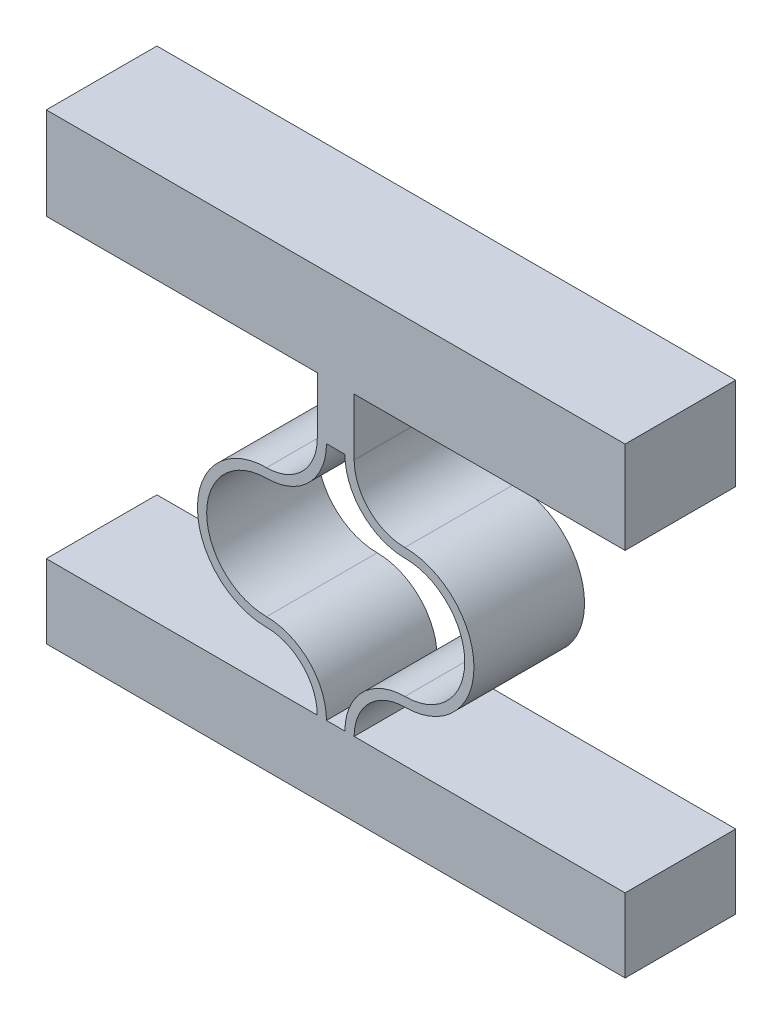
ISO-10303-21;
HEADER;
FILE_DESCRIPTION(('STEP AP214'),'2;1');
FILE_NAME('part.step','',(''),(''),'','','');
FILE_SCHEMA(('AUTOMOTIVE_DESIGN { 1 0 10303 214 1 1 1 1 }'));
ENDSEC;
DATA;
#1=APPLICATION_CONTEXT('core data for automotive mechanical design processes');
#2=APPLICATION_PROTOCOL_DEFINITION('international standard','automotive_design',2000,#1);
#3=PRODUCT_CONTEXT('',#1,'mechanical');
#4=PRODUCT('Part','Part','',(#3));
#5=PRODUCT_RELATED_PRODUCT_CATEGORY('part','',(#4));
#6=PRODUCT_DEFINITION_FORMATION('','',#4);
#7=PRODUCT_DEFINITION_CONTEXT('part definition',#1,'design');
#8=PRODUCT_DEFINITION('design','',#6,#7);
#9=PRODUCT_DEFINITION_SHAPE('','',#8);
#10=(LENGTH_UNIT() NAMED_UNIT(*) SI_UNIT(.MILLI.,.METRE.));
#11=(NAMED_UNIT(*) PLANE_ANGLE_UNIT() SI_UNIT($,.RADIAN.));
#12=(NAMED_UNIT(*) SI_UNIT($,.STERADIAN.) SOLID_ANGLE_UNIT());
#13=UNCERTAINTY_MEASURE_WITH_UNIT(LENGTH_MEASURE(1.E-05),#10,'distance_accuracy_value','');
#14=(GEOMETRIC_REPRESENTATION_CONTEXT(3) GLOBAL_UNCERTAINTY_ASSIGNED_CONTEXT((#13)) GLOBAL_UNIT_ASSIGNED_CONTEXT((#10,
#11,#12)) REPRESENTATION_CONTEXT('',''));
#15=CARTESIAN_POINT('',(0.,0.,0.));
#16=DIRECTION('',(0.,0.,1.));
#17=DIRECTION('',(1.,0.,0.));
#18=AXIS2_PLACEMENT_3D('',#15,#16,#17);
#19=CARTESIAN_POINT('',(13.4500001740405,13.,6.));
#20=DIRECTION('',(0.,0.,-1.));
#21=DIRECTION('',(-1.,0.,0.));
#22=AXIS2_PLACEMENT_3D('',#19,#20,#21);
#23=CYLINDRICAL_SURFACE('',#22,3.25);
#24=CARTESIAN_POINT('',(13.4500001740405,13.,0.));
#25=DIRECTION('',(0.,0.,1.));
#26=DIRECTION('',(1.,0.,0.));
#27=AXIS2_PLACEMENT_3D('',#24,#25,#26);
#28=CIRCLE('',#27,3.25);
#29=CARTESIAN_POINT('',(10.2000001740405,13.,0.));
#30=VERTEX_POINT('',#29);
#31=CARTESIAN_POINT('',(13.4500001740405,9.75,0.));
#32=VERTEX_POINT('',#31);
#33=EDGE_CURVE('E347',#30,#32,#28,.T.);
#34=ORIENTED_EDGE('',*,*,#33,.T.);
#35=DIRECTION('',(0.,0.,-1.));
#36=VECTOR('',#35,1.);
#37=CARTESIAN_POINT('',(13.4500001740405,9.75,6.));
#38=LINE('',#37,#36);
#39=CARTESIAN_POINT('',(13.4500001740405,9.75,6.));
#40=VERTEX_POINT('',#39);
#41=EDGE_CURVE('E310',#40,#32,#38,.T.);
#42=ORIENTED_EDGE('',*,*,#41,.F.);
#43=CARTESIAN_POINT('',(13.4500001740405,13.,6.));
#44=DIRECTION('',(0.,0.,1.));
#45=DIRECTION('',(1.,0.,0.));
#46=AXIS2_PLACEMENT_3D('',#43,#44,#45);
#47=CIRCLE('',#46,3.25);
#48=CARTESIAN_POINT('',(10.2000001740405,13.,6.));
#49=VERTEX_POINT('',#48);
#50=EDGE_CURVE('E370',#49,#40,#47,.T.);
#51=ORIENTED_EDGE('',*,*,#50,.F.);
#52=DIRECTION('',(0.,0.,-1.));
#53=VECTOR('',#52,1.);
#54=CARTESIAN_POINT('',(10.2000001740405,13.,6.));
#55=LINE('',#54,#53);
#56=EDGE_CURVE('E314',#49,#30,#55,.T.);
#57=ORIENTED_EDGE('',*,*,#56,.T.);
#58=EDGE_LOOP('',(#34,#42,#51,#57));
#59=FACE_BOUND('',#58,.T.);
#60=ADVANCED_FACE('F42',(#59),#23,.T.);
#61=CARTESIAN_POINT('',(13.4500001740405,6.5,6.));
#62=DIRECTION('',(0.,0.,-1.));
#63=DIRECTION('',(-1.,0.,0.));
#64=AXIS2_PLACEMENT_3D('',#61,#62,#63);
#65=CYLINDRICAL_SURFACE('',#64,3.25);
#66=CARTESIAN_POINT('',(13.4500001740405,6.5,0.));
#67=DIRECTION('',(0.,0.,1.));
#68=DIRECTION('',(1.,0.,0.));
#69=AXIS2_PLACEMENT_3D('',#66,#67,#68);
#70=CIRCLE('',#69,3.25);
#71=CARTESIAN_POINT('',(13.4500001740405,3.25,0.));
#72=VERTEX_POINT('',#71);
#73=EDGE_CURVE('E344',#32,#72,#70,.F.);
#74=ORIENTED_EDGE('',*,*,#73,.T.);
#75=DIRECTION('',(0.,0.,-1.));
#76=VECTOR('',#75,1.);
#77=CARTESIAN_POINT('',(13.4500001740405,3.25,6.));
#78=LINE('',#77,#76);
#79=CARTESIAN_POINT('',(13.4500001740405,3.25,6.));
#80=VERTEX_POINT('',#79);
#81=EDGE_CURVE('E313',#80,#72,#78,.T.);
#82=ORIENTED_EDGE('',*,*,#81,.F.);
#83=CARTESIAN_POINT('',(13.4500001740405,6.5,6.));
#84=DIRECTION('',(0.,0.,1.));
#85=DIRECTION('',(1.,0.,0.));
#86=AXIS2_PLACEMENT_3D('',#83,#84,#85);
#87=CIRCLE('',#86,3.25);
#88=EDGE_CURVE('E367',#40,#80,#87,.F.);
#89=ORIENTED_EDGE('',*,*,#88,.F.);
#90=ORIENTED_EDGE('',*,*,#41,.T.);
#91=EDGE_LOOP('',(#74,#82,#89,#90));
#92=FACE_BOUND('',#91,.T.);
#93=ADVANCED_FACE('F427',(#92),#65,.F.);
#94=CARTESIAN_POINT('',(13.4500001740405,0.,6.));
#95=DIRECTION('',(0.,0.,-1.));
#96=DIRECTION('',(-1.,0.,0.));
#97=AXIS2_PLACEMENT_3D('',#94,#95,#96);
#98=CYLINDRICAL_SURFACE('',#97,3.25);
#99=CARTESIAN_POINT('',(13.4500001740405,0.,0.));
#100=DIRECTION('',(0.,0.,1.));
#101=DIRECTION('',(1.,0.,0.));
#102=AXIS2_PLACEMENT_3D('',#99,#100,#101);
#103=CIRCLE('',#102,3.25);
#104=CARTESIAN_POINT('',(10.2000001740405,0.,0.));
#105=VERTEX_POINT('',#104);
#106=EDGE_CURVE('E342',#72,#105,#103,.T.);
#107=ORIENTED_EDGE('',*,*,#106,.T.);
#108=DIRECTION('',(0.,0.,-1.));
#109=VECTOR('',#108,1.);
#110=CARTESIAN_POINT('',(10.2000001740405,0.,6.));
#111=LINE('',#110,#109);
#112=CARTESIAN_POINT('',(10.2000001740405,0.,6.));
#113=VERTEX_POINT('',#112);
#114=EDGE_CURVE('E309',#113,#105,#111,.T.);
#115=ORIENTED_EDGE('',*,*,#114,.F.);
#116=CARTESIAN_POINT('',(13.4500001740405,0.,6.));
#117=DIRECTION('',(0.,0.,1.));
#118=DIRECTION('',(1.,0.,0.));
#119=AXIS2_PLACEMENT_3D('',#116,#117,#118);
#120=CIRCLE('',#119,3.25);
#121=EDGE_CURVE('E365',#80,#113,#120,.T.);
#122=ORIENTED_EDGE('',*,*,#121,.F.);
#123=ORIENTED_EDGE('',*,*,#81,.T.);
#124=EDGE_LOOP('',(#107,#115,#122,#123));
#125=FACE_BOUND('',#124,.T.);
#126=ADVANCED_FACE('F433',(#125),#98,.T.);
#127=CARTESIAN_POINT('',(0.,-4.00000000000024,6.));
#128=DIRECTION('',(0.,1.,0.));
#129=DIRECTION('',(-1.,0.,0.));
#130=AXIS2_PLACEMENT_3D('',#127,#128,#129);
#131=PLANE('',#130);
#132=DIRECTION('',(1.,0.,0.));
#133=VECTOR('',#132,1.);
#134=CARTESIAN_POINT('',(0.,-4.00000000000024,6.));
#135=LINE('',#134,#133);
#136=CARTESIAN_POINT('',(-5.99999965738466,-4.00000000000024,6.));
#137=VERTEX_POINT('',#136);
#138=CARTESIAN_POINT('',(25.4000000054657,-4.00000000000024,6.));
#139=VERTEX_POINT('',#138);
#140=EDGE_CURVE('E353',#137,#139,#135,.T.);
#141=ORIENTED_EDGE('',*,*,#140,.F.);
#142=DIRECTION('',(0.,0.,-1.));
#143=VECTOR('',#142,1.);
#144=CARTESIAN_POINT('',(-5.99999965738466,-4.00000000000024,6.));
#145=LINE('',#144,#143);
#146=CARTESIAN_POINT('',(-5.99999965738466,-4.00000000000024,0.));
#147=VERTEX_POINT('',#146);
#148=EDGE_CURVE('E252',#137,#147,#145,.T.);
#149=ORIENTED_EDGE('',*,*,#148,.T.);
#150=DIRECTION('',(1.,0.,0.));
#151=VECTOR('',#150,1.);
#152=CARTESIAN_POINT('',(0.,-4.00000000000024,0.));
#153=LINE('',#152,#151);
#154=CARTESIAN_POINT('',(25.4000000054657,-4.00000000000024,0.));
#155=VERTEX_POINT('',#154);
#156=EDGE_CURVE('E46',#147,#155,#153,.T.);
#157=ORIENTED_EDGE('',*,*,#156,.T.);
#158=DIRECTION('',(0.,0.,-1.));
#159=VECTOR('',#158,1.);
#160=CARTESIAN_POINT('',(25.4000000054657,-4.00000000000024,6.));
#161=LINE('',#160,#159);
#162=EDGE_CURVE('E322',#139,#155,#161,.T.);
#163=ORIENTED_EDGE('',*,*,#162,.F.);
#164=EDGE_LOOP('',(#141,#149,#157,#163));
#165=FACE_BOUND('',#164,.T.);
#166=ADVANCED_FACE('F386',(#165),#131,.F.);
#167=CARTESIAN_POINT('',(25.4000000054657,0.,6.));
#168=DIRECTION('',(-1.,0.,0.));
#169=DIRECTION('',(0.,0.,1.));
#170=AXIS2_PLACEMENT_3D('',#167,#168,#169);
#171=PLANE('',#170);
#172=DIRECTION('',(0.,1.,0.));
#173=VECTOR('',#172,1.);
#174=CARTESIAN_POINT('',(25.4000000054657,0.,0.));
#175=LINE('',#174,#173);
#176=CARTESIAN_POINT('',(25.4000000054657,0.,0.));
#177=VERTEX_POINT('',#176);
#178=EDGE_CURVE('E330',#155,#177,#175,.T.);
#179=ORIENTED_EDGE('',*,*,#178,.T.);
#180=DIRECTION('',(0.,0.,1.));
#181=VECTOR('',#180,1.);
#182=CARTESIAN_POINT('',(25.4000000054657,0.,0.));
#183=LINE('',#182,#181);
#184=CARTESIAN_POINT('',(25.4000000054657,0.,6.));
#185=VERTEX_POINT('',#184);
#186=EDGE_CURVE('E242',#177,#185,#183,.T.);
#187=ORIENTED_EDGE('',*,*,#186,.T.);
#188=DIRECTION('',(0.,1.,0.));
#189=VECTOR('',#188,1.);
#190=CARTESIAN_POINT('',(25.4000000054657,0.,6.));
#191=LINE('',#190,#189);
#192=EDGE_CURVE('E317',#139,#185,#191,.T.);
#193=ORIENTED_EDGE('',*,*,#192,.F.);
#194=ORIENTED_EDGE('',*,*,#162,.T.);
#195=EDGE_LOOP('',(#179,#187,#193,#194));
#196=FACE_BOUND('',#195,.T.);
#197=ADVANCED_FACE('F385',(#196),#171,.F.);
#198=CARTESIAN_POINT('',(10.7000399753727,-2.72436541784591E-12,6.));
#199=DIRECTION('',(-1.,2.54612639215959E-13,0.));
#200=DIRECTION('',(-2.54612639215959E-13,-1.,0.));
#201=AXIS2_PLACEMENT_3D('',#198,#199,#200);
#202=PLANE('',#201);
#203=DIRECTION('',(2.54612639215959E-13,1.,0.));
#204=VECTOR('',#203,1.);
#205=CARTESIAN_POINT('',(10.7000399753727,-2.72436541784591E-12,0.));
#206=LINE('',#205,#204);
#207=CARTESIAN_POINT('',(10.7000399753764,12.9852045357247,0.));
#208=VERTEX_POINT('',#207);
#209=CARTESIAN_POINT('',(10.7000399753764,16.0852045357246,0.));
#210=VERTEX_POINT('',#209);
#211=EDGE_CURVE('E51',#208,#210,#206,.T.);
#212=ORIENTED_EDGE('',*,*,#211,.T.);
#213=DIRECTION('',(0.,0.,-1.));
#214=VECTOR('',#213,1.);
#215=CARTESIAN_POINT('',(10.7000399753764,16.0852045357246,6.));
#216=LINE('',#215,#214);
#217=CARTESIAN_POINT('',(10.7000399753764,16.0852045357246,6.));
#218=VERTEX_POINT('',#217);
#219=EDGE_CURVE('E12',#218,#210,#216,.T.);
#220=ORIENTED_EDGE('',*,*,#219,.F.);
#221=DIRECTION('',(2.54612639215959E-13,1.,0.));
#222=VECTOR('',#221,1.);
#223=CARTESIAN_POINT('',(10.7000399753727,-2.72436541784591E-12,6.));
#224=LINE('',#223,#222);
#225=CARTESIAN_POINT('',(10.7000399753764,12.9852045357247,6.));
#226=VERTEX_POINT('',#225);
#227=EDGE_CURVE('E67',#226,#218,#224,.T.);
#228=ORIENTED_EDGE('',*,*,#227,.F.);
#229=DIRECTION('',(0.,0.,-1.));
#230=VECTOR('',#229,1.);
#231=CARTESIAN_POINT('',(10.7000399753764,12.9852045357247,6.));
#232=LINE('',#231,#230);
#233=EDGE_CURVE('E318',#226,#208,#232,.T.);
#234=ORIENTED_EDGE('',*,*,#233,.T.);
#235=EDGE_LOOP('',(#212,#220,#228,#234));
#236=FACE_BOUND('',#235,.T.);
#237=ADVANCED_FACE('F437',(#236),#202,.F.);
#238=CARTESIAN_POINT('',(0.,0.,6.));
#239=DIRECTION('',(0.,1.,0.));
#240=DIRECTION('',(-1.,0.,0.));
#241=AXIS2_PLACEMENT_3D('',#238,#239,#240);
#242=PLANE('',#241);
#243=DIRECTION('',(1.,0.,0.));
#244=VECTOR('',#243,1.);
#245=CARTESIAN_POINT('',(0.,0.,0.));
#246=LINE('',#245,#244);
#247=CARTESIAN_POINT('',(10.7000001740405,0.,0.));
#248=VERTEX_POINT('',#247);
#249=EDGE_CURVE('E59',#248,#177,#246,.T.);
#250=ORIENTED_EDGE('',*,*,#249,.F.);
#251=DIRECTION('',(0.,0.,-1.));
#252=VECTOR('',#251,1.);
#253=CARTESIAN_POINT('',(10.7000001740405,0.,6.));
#254=LINE('',#253,#252);
#255=CARTESIAN_POINT('',(10.7000001740405,0.,6.));
#256=VERTEX_POINT('',#255);
#257=EDGE_CURVE('E321',#256,#248,#254,.T.);
#258=ORIENTED_EDGE('',*,*,#257,.F.);
#259=DIRECTION('',(1.,0.,0.));
#260=VECTOR('',#259,1.);
#261=CARTESIAN_POINT('',(0.,0.,6.));
#262=LINE('',#261,#260);
#263=EDGE_CURVE('E360',#256,#185,#262,.T.);
#264=ORIENTED_EDGE('',*,*,#263,.T.);
#265=ORIENTED_EDGE('',*,*,#186,.F.);
#266=EDGE_LOOP('',(#250,#258,#264,#265));
#267=FACE_BOUND('',#266,.T.);
#268=ADVANCED_FACE('F448',(#267),#242,.T.);
#269=CARTESIAN_POINT('',(13.4500001740405,0.,6.));
#270=DIRECTION('',(0.,0.,-1.));
#271=DIRECTION('',(-1.,0.,0.));
#272=AXIS2_PLACEMENT_3D('',#269,#270,#271);
#273=CYLINDRICAL_SURFACE('',#272,2.75);
#274=CARTESIAN_POINT('',(13.4500001740405,0.,0.));
#275=DIRECTION('',(0.,0.,1.));
#276=DIRECTION('',(1.,0.,0.));
#277=AXIS2_PLACEMENT_3D('',#274,#275,#276);
#278=CIRCLE('',#277,2.75);
#279=CARTESIAN_POINT('',(13.4500001740405,2.75,0.));
#280=VERTEX_POINT('',#279);
#281=EDGE_CURVE('E336',#280,#248,#278,.T.);
#282=ORIENTED_EDGE('',*,*,#281,.F.);
#283=DIRECTION('',(0.,0.,-1.));
#284=VECTOR('',#283,1.);
#285=CARTESIAN_POINT('',(13.4500001740405,2.75,6.));
#286=LINE('',#285,#284);
#287=CARTESIAN_POINT('',(13.4500001740405,2.75,6.));
#288=VERTEX_POINT('',#287);
#289=EDGE_CURVE('E324',#288,#280,#286,.T.);
#290=ORIENTED_EDGE('',*,*,#289,.F.);
#291=CARTESIAN_POINT('',(13.4500001740405,0.,6.));
#292=DIRECTION('',(0.,0.,1.));
#293=DIRECTION('',(1.,0.,0.));
#294=AXIS2_PLACEMENT_3D('',#291,#292,#293);
#295=CIRCLE('',#294,2.75);
#296=EDGE_CURVE('E357',#288,#256,#295,.T.);
#297=ORIENTED_EDGE('',*,*,#296,.T.);
#298=ORIENTED_EDGE('',*,*,#257,.T.);
#299=EDGE_LOOP('',(#282,#290,#297,#298));
#300=FACE_BOUND('',#299,.T.);
#301=ADVANCED_FACE('F451',(#300),#273,.F.);
#302=CARTESIAN_POINT('',(13.4500001740405,6.5,6.));
#303=DIRECTION('',(0.,0.,-1.));
#304=DIRECTION('',(-1.,0.,0.));
#305=AXIS2_PLACEMENT_3D('',#302,#303,#304);
#306=CYLINDRICAL_SURFACE('',#305,3.75);
#307=CARTESIAN_POINT('',(13.4500001740405,6.5,0.));
#308=DIRECTION('',(0.,0.,1.));
#309=DIRECTION('',(1.,0.,0.));
#310=AXIS2_PLACEMENT_3D('',#307,#308,#309);
#311=CIRCLE('',#310,3.75);
#312=CARTESIAN_POINT('',(13.4500001740405,10.25,0.));
#313=VERTEX_POINT('',#312);
#314=EDGE_CURVE('E333',#313,#280,#311,.F.);
#315=ORIENTED_EDGE('',*,*,#314,.F.);
#316=DIRECTION('',(0.,0.,-1.));
#317=VECTOR('',#316,1.);
#318=CARTESIAN_POINT('',(13.4500001740405,10.25,6.));
#319=LINE('',#318,#317);
#320=CARTESIAN_POINT('',(13.4500001740405,10.25,6.));
#321=VERTEX_POINT('',#320);
#322=EDGE_CURVE('E326',#321,#313,#319,.T.);
#323=ORIENTED_EDGE('',*,*,#322,.F.);
#324=CARTESIAN_POINT('',(13.4500001740405,6.5,6.));
#325=DIRECTION('',(0.,0.,1.));
#326=DIRECTION('',(1.,0.,0.));
#327=AXIS2_PLACEMENT_3D('',#324,#325,#326);
#328=CIRCLE('',#327,3.75);
#329=EDGE_CURVE('E354',#321,#288,#328,.F.);
#330=ORIENTED_EDGE('',*,*,#329,.T.);
#331=ORIENTED_EDGE('',*,*,#289,.T.);
#332=EDGE_LOOP('',(#315,#323,#330,#331));
#333=FACE_BOUND('',#332,.T.);
#334=ADVANCED_FACE('F446',(#333),#306,.T.);
#335=CARTESIAN_POINT('',(13.4500001740405,13.,6.));
#336=DIRECTION('',(0.,0.,-1.));
#337=DIRECTION('',(-1.,0.,0.));
#338=AXIS2_PLACEMENT_3D('',#335,#336,#337);
#339=CYLINDRICAL_SURFACE('',#338,2.75);
#340=CARTESIAN_POINT('',(13.4500001740405,13.,0.));
#341=DIRECTION('',(0.,0.,1.));
#342=DIRECTION('',(1.,0.,0.));
#343=AXIS2_PLACEMENT_3D('',#340,#341,#342);
#344=CIRCLE('',#343,2.75);
#345=EDGE_CURVE('E339',#208,#313,#344,.T.);
#346=ORIENTED_EDGE('',*,*,#345,.F.);
#347=ORIENTED_EDGE('',*,*,#233,.F.);
#348=CARTESIAN_POINT('',(13.4500001740405,13.,6.));
#349=DIRECTION('',(0.,0.,1.));
#350=DIRECTION('',(1.,0.,0.));
#351=AXIS2_PLACEMENT_3D('',#348,#349,#350);
#352=CIRCLE('',#351,2.75);
#353=EDGE_CURVE('E362',#226,#321,#352,.T.);
#354=ORIENTED_EDGE('',*,*,#353,.T.);
#355=ORIENTED_EDGE('',*,*,#322,.T.);
#356=EDGE_LOOP('',(#346,#347,#354,#355));
#357=FACE_BOUND('',#356,.T.);
#358=ADVANCED_FACE('F443',(#357),#339,.F.);
#359=CARTESIAN_POINT('',(0.,0.,6.));
#360=DIRECTION('',(0.,0.,1.));
#361=DIRECTION('',(1.,0.,0.));
#362=AXIS2_PLACEMENT_3D('',#359,#360,#361);
#363=PLANE('',#362);
#364=DIRECTION('',(-1.,0.,0.));
#365=VECTOR('',#364,1.);
#366=CARTESIAN_POINT('',(19.400000348081,0.,6.));
#367=LINE('',#366,#365);
#368=CARTESIAN_POINT('',(8.7000001740405,0.,6.));
#369=VERTEX_POINT('',#368);
#370=CARTESIAN_POINT('',(-5.99999965738466,0.,6.));
#371=VERTEX_POINT('',#370);
#372=EDGE_CURVE('E275',#369,#371,#367,.T.);
#373=ORIENTED_EDGE('',*,*,#372,.T.);
#374=DIRECTION('',(0.,1.,0.));
#375=VECTOR('',#374,1.);
#376=CARTESIAN_POINT('',(-5.99999965738466,0.,6.));
#377=LINE('',#376,#375);
#378=EDGE_CURVE('E240',#137,#371,#377,.T.);
#379=ORIENTED_EDGE('',*,*,#378,.F.);
#380=ORIENTED_EDGE('',*,*,#140,.T.);
#381=ORIENTED_EDGE('',*,*,#192,.T.);
#382=ORIENTED_EDGE('',*,*,#263,.F.);
#383=ORIENTED_EDGE('',*,*,#296,.F.);
#384=ORIENTED_EDGE('',*,*,#329,.F.);
#385=ORIENTED_EDGE('',*,*,#353,.F.);
#386=ORIENTED_EDGE('',*,*,#227,.T.);
#387=DIRECTION('',(1.,0.,0.));
#388=VECTOR('',#387,1.);
#389=CARTESIAN_POINT('',(-5.99999965738466,16.0852045357246,6.));
#390=LINE('',#389,#388);
#391=CARTESIAN_POINT('',(25.4000000054657,16.0852045357246,6.));
#392=VERTEX_POINT('',#391);
#393=EDGE_CURVE('E535',#218,#392,#390,.T.);
#394=ORIENTED_EDGE('',*,*,#393,.T.);
#395=DIRECTION('',(0.,1.,0.));
#396=VECTOR('',#395,1.);
#397=CARTESIAN_POINT('',(25.4000000054657,21.085204541115,6.));
#398=LINE('',#397,#396);
#399=CARTESIAN_POINT('',(25.4000000054657,21.085204541115,6.));
#400=VERTEX_POINT('',#399);
#401=EDGE_CURVE('E530',#392,#400,#398,.T.);
#402=ORIENTED_EDGE('',*,*,#401,.T.);
#403=DIRECTION('',(-1.,0.,0.));
#404=VECTOR('',#403,1.);
#405=CARTESIAN_POINT('',(-5.99999965738466,21.085204541115,6.));
#406=LINE('',#405,#404);
#407=CARTESIAN_POINT('',(-5.99999965738466,21.085204541115,6.));
#408=VERTEX_POINT('',#407);
#409=EDGE_CURVE('E520',#400,#408,#406,.T.);
#410=ORIENTED_EDGE('',*,*,#409,.T.);
#411=DIRECTION('',(0.,-1.,0.));
#412=VECTOR('',#411,1.);
#413=CARTESIAN_POINT('',(-5.99999965738466,21.085204541115,6.));
#414=LINE('',#413,#412);
#415=CARTESIAN_POINT('',(-5.99999965738466,16.0852045357246,6.));
#416=VERTEX_POINT('',#415);
#417=EDGE_CURVE('E241',#408,#416,#414,.T.);
#418=ORIENTED_EDGE('',*,*,#417,.T.);
#419=CARTESIAN_POINT('',(8.69996037270463,16.0852045357246,6.));
#420=VERTEX_POINT('',#419);
#421=EDGE_CURVE('E533',#416,#420,#390,.T.);
#422=ORIENTED_EDGE('',*,*,#421,.T.);
#423=DIRECTION('',(-2.54612639215959E-13,1.,0.));
#424=VECTOR('',#423,1.);
#425=CARTESIAN_POINT('',(8.69996037270832,-2.72436541784591E-12,6.));
#426=LINE('',#425,#424);
#427=CARTESIAN_POINT('',(8.69996037270463,12.9852045357247,6.));
#428=VERTEX_POINT('',#427);
#429=EDGE_CURVE('E246',#428,#420,#426,.T.);
#430=ORIENTED_EDGE('',*,*,#429,.F.);
#431=CARTESIAN_POINT('',(5.9500001740405,13.,6.));
#432=DIRECTION('',(0.,0.,-1.));
#433=DIRECTION('',(-1.,0.,0.));
#434=AXIS2_PLACEMENT_3D('',#431,#432,#433);
#435=CIRCLE('',#434,2.75);
#436=CARTESIAN_POINT('',(5.9500001740405,10.25,6.));
#437=VERTEX_POINT('',#436);
#438=EDGE_CURVE('E277',#428,#437,#435,.T.);
#439=ORIENTED_EDGE('',*,*,#438,.T.);
#440=CARTESIAN_POINT('',(5.9500001740405,6.5,6.));
#441=DIRECTION('',(0.,0.,-1.));
#442=DIRECTION('',(-1.,0.,0.));
#443=AXIS2_PLACEMENT_3D('',#440,#441,#442);
#444=CIRCLE('',#443,3.75);
#445=CARTESIAN_POINT('',(5.9500001740405,2.75,6.));
#446=VERTEX_POINT('',#445);
#447=EDGE_CURVE('E270',#437,#446,#444,.F.);
#448=ORIENTED_EDGE('',*,*,#447,.T.);
#449=CARTESIAN_POINT('',(5.9500001740405,0.,6.));
#450=DIRECTION('',(0.,0.,-1.));
#451=DIRECTION('',(-1.,0.,0.));
#452=AXIS2_PLACEMENT_3D('',#449,#450,#451);
#453=CIRCLE('',#452,2.75);
#454=EDGE_CURVE('E273',#446,#369,#453,.T.);
#455=ORIENTED_EDGE('',*,*,#454,.T.);
#456=EDGE_LOOP('',(#373,#379,#380,#381,#382,#383,#384,#385,#386,#394,#402,#410,#418,#422,#430,
#439,#448,#455));
#457=FACE_BOUND('',#456,.T.);
#458=DIRECTION('',(1.,0.,0.));
#459=VECTOR('',#458,1.);
#460=CARTESIAN_POINT('',(9.7000001740405,0.,6.));
#461=LINE('',#460,#459);
#462=CARTESIAN_POINT('',(9.2000001740405,0.,6.));
#463=VERTEX_POINT('',#462);
#464=EDGE_CURVE('E303',#463,#113,#461,.T.);
#465=ORIENTED_EDGE('',*,*,#464,.F.);
#466=CARTESIAN_POINT('',(5.9500001740405,0.,6.));
#467=DIRECTION('',(0.,0.,-1.));
#468=DIRECTION('',(-1.,0.,0.));
#469=AXIS2_PLACEMENT_3D('',#466,#467,#468);
#470=CIRCLE('',#469,3.25);
#471=CARTESIAN_POINT('',(5.9500001740405,3.25,6.));
#472=VERTEX_POINT('',#471);
#473=EDGE_CURVE('E279',#472,#463,#470,.T.);
#474=ORIENTED_EDGE('',*,*,#473,.F.);
#475=CARTESIAN_POINT('',(5.9500001740405,6.5,6.));
#476=DIRECTION('',(0.,0.,-1.));
#477=DIRECTION('',(-1.,0.,0.));
#478=AXIS2_PLACEMENT_3D('',#475,#476,#477);
#479=CIRCLE('',#478,3.25);
#480=CARTESIAN_POINT('',(5.9500001740405,9.75,6.));
#481=VERTEX_POINT('',#480);
#482=EDGE_CURVE('E282',#481,#472,#479,.F.);
#483=ORIENTED_EDGE('',*,*,#482,.F.);
#484=CARTESIAN_POINT('',(5.9500001740405,13.,6.));
#485=DIRECTION('',(0.,0.,-1.));
#486=DIRECTION('',(-1.,0.,0.));
#487=AXIS2_PLACEMENT_3D('',#484,#485,#486);
#488=CIRCLE('',#487,3.25);
#489=CARTESIAN_POINT('',(9.2000001740405,13.,6.));
#490=VERTEX_POINT('',#489);
#491=EDGE_CURVE('E249',#490,#481,#488,.T.);
#492=ORIENTED_EDGE('',*,*,#491,.F.);
#493=DIRECTION('',(1.,0.,0.));
#494=VECTOR('',#493,1.);
#495=CARTESIAN_POINT('',(9.7000001740405,13.,6.));
#496=LINE('',#495,#494);
#497=EDGE_CURVE('E289',#490,#49,#496,.T.);
#498=ORIENTED_EDGE('',*,*,#497,.T.);
#499=ORIENTED_EDGE('',*,*,#50,.T.);
#500=ORIENTED_EDGE('',*,*,#88,.T.);
#501=ORIENTED_EDGE('',*,*,#121,.T.);
#502=EDGE_LOOP('',(#465,#474,#483,#492,#498,#499,#500,#501));
#503=FACE_BOUND('',#502,.T.);
#504=ADVANCED_FACE('F378',(#457,#503),#363,.T.);
#505=CARTESIAN_POINT('',(0.,0.,0.));
#506=DIRECTION('',(0.,0.,1.));
#507=DIRECTION('',(1.,0.,0.));
#508=AXIS2_PLACEMENT_3D('',#505,#506,#507);
#509=PLANE('',#508);
#510=DIRECTION('',(0.,1.,0.));
#511=VECTOR('',#510,1.);
#512=CARTESIAN_POINT('',(-5.99999965738466,0.,0.));
#513=LINE('',#512,#511);
#514=CARTESIAN_POINT('',(-5.99999965738466,0.,0.));
#515=VERTEX_POINT('',#514);
#516=EDGE_CURVE('E237',#147,#515,#513,.T.);
#517=ORIENTED_EDGE('',*,*,#516,.T.);
#518=DIRECTION('',(-1.,0.,0.));
#519=VECTOR('',#518,1.);
#520=CARTESIAN_POINT('',(19.400000348081,0.,0.));
#521=LINE('',#520,#519);
#522=CARTESIAN_POINT('',(8.7000001740405,0.,0.));
#523=VERTEX_POINT('',#522);
#524=EDGE_CURVE('E220',#523,#515,#521,.T.);
#525=ORIENTED_EDGE('',*,*,#524,.F.);
#526=CARTESIAN_POINT('',(5.9500001740405,0.,0.));
#527=DIRECTION('',(0.,0.,-1.));
#528=DIRECTION('',(-1.,0.,0.));
#529=AXIS2_PLACEMENT_3D('',#526,#527,#528);
#530=CIRCLE('',#529,2.75);
#531=CARTESIAN_POINT('',(5.9500001740405,2.75,0.));
#532=VERTEX_POINT('',#531);
#533=EDGE_CURVE('E231',#532,#523,#530,.T.);
#534=ORIENTED_EDGE('',*,*,#533,.F.);
#535=CARTESIAN_POINT('',(5.9500001740405,6.5,0.));
#536=DIRECTION('',(0.,0.,-1.));
#537=DIRECTION('',(-1.,0.,0.));
#538=AXIS2_PLACEMENT_3D('',#535,#536,#537);
#539=CIRCLE('',#538,3.75);
#540=CARTESIAN_POINT('',(5.9500001740405,10.25,0.));
#541=VERTEX_POINT('',#540);
#542=EDGE_CURVE('E245',#541,#532,#539,.F.);
#543=ORIENTED_EDGE('',*,*,#542,.F.);
#544=CARTESIAN_POINT('',(5.9500001740405,13.,0.));
#545=DIRECTION('',(0.,0.,-1.));
#546=DIRECTION('',(-1.,0.,0.));
#547=AXIS2_PLACEMENT_3D('',#544,#545,#546);
#548=CIRCLE('',#547,2.75);
#549=CARTESIAN_POINT('',(8.69996037270463,12.9852045357247,0.));
#550=VERTEX_POINT('',#549);
#551=EDGE_CURVE('E230',#550,#541,#548,.T.);
#552=ORIENTED_EDGE('',*,*,#551,.F.);
#553=DIRECTION('',(-2.54612639215959E-13,1.,0.));
#554=VECTOR('',#553,1.);
#555=CARTESIAN_POINT('',(8.69996037270832,-2.72436541784591E-12,0.));
#556=LINE('',#555,#554);
#557=CARTESIAN_POINT('',(8.69996037270463,16.0852045357246,0.));
#558=VERTEX_POINT('',#557);
#559=EDGE_CURVE('E266',#550,#558,#556,.T.);
#560=ORIENTED_EDGE('',*,*,#559,.T.);
#561=DIRECTION('',(-1.,0.,0.));
#562=VECTOR('',#561,1.);
#563=CARTESIAN_POINT('',(-5.99999965738466,16.0852045357246,0.));
#564=LINE('',#563,#562);
#565=CARTESIAN_POINT('',(-5.99999965738466,16.0852045357246,0.));
#566=VERTEX_POINT('',#565);
#567=EDGE_CURVE('E516',#558,#566,#564,.T.);
#568=ORIENTED_EDGE('',*,*,#567,.T.);
#569=DIRECTION('',(0.,1.,0.));
#570=VECTOR('',#569,1.);
#571=CARTESIAN_POINT('',(-5.99999965738466,21.085204541115,0.));
#572=LINE('',#571,#570);
#573=CARTESIAN_POINT('',(-5.99999965738466,21.085204541115,0.));
#574=VERTEX_POINT('',#573);
#575=EDGE_CURVE('E538',#566,#574,#572,.T.);
#576=ORIENTED_EDGE('',*,*,#575,.T.);
#577=DIRECTION('',(1.,0.,0.));
#578=VECTOR('',#577,1.);
#579=CARTESIAN_POINT('',(-5.99999965738466,21.085204541115,0.));
#580=LINE('',#579,#578);
#581=CARTESIAN_POINT('',(25.4000000054657,21.085204541115,0.));
#582=VERTEX_POINT('',#581);
#583=EDGE_CURVE('E540',#574,#582,#580,.T.);
#584=ORIENTED_EDGE('',*,*,#583,.T.);
#585=DIRECTION('',(0.,-1.,0.));
#586=VECTOR('',#585,1.);
#587=CARTESIAN_POINT('',(25.4000000054657,21.085204541115,0.));
#588=LINE('',#587,#586);
#589=CARTESIAN_POINT('',(25.4000000054657,16.0852045357246,0.));
#590=VERTEX_POINT('',#589);
#591=EDGE_CURVE('E527',#582,#590,#588,.T.);
#592=ORIENTED_EDGE('',*,*,#591,.T.);
#593=EDGE_CURVE('E298',#590,#210,#564,.T.);
#594=ORIENTED_EDGE('',*,*,#593,.T.);
#595=ORIENTED_EDGE('',*,*,#211,.F.);
#596=ORIENTED_EDGE('',*,*,#345,.T.);
#597=ORIENTED_EDGE('',*,*,#314,.T.);
#598=ORIENTED_EDGE('',*,*,#281,.T.);
#599=ORIENTED_EDGE('',*,*,#249,.T.);
#600=ORIENTED_EDGE('',*,*,#178,.F.);
#601=ORIENTED_EDGE('',*,*,#156,.F.);
#602=EDGE_LOOP('',(#517,#525,#534,#543,#552,#560,#568,#576,#584,#592,#594,#595,#596,#597,#598,
#599,#600,#601));
#603=FACE_BOUND('',#602,.T.);
#604=ORIENTED_EDGE('',*,*,#33,.F.);
#605=DIRECTION('',(1.,0.,0.));
#606=VECTOR('',#605,1.);
#607=CARTESIAN_POINT('',(9.7000001740405,13.,0.));
#608=LINE('',#607,#606);
#609=CARTESIAN_POINT('',(9.2000001740405,13.,0.));
#610=VERTEX_POINT('',#609);
#611=EDGE_CURVE('E301',#610,#30,#608,.T.);
#612=ORIENTED_EDGE('',*,*,#611,.F.);
#613=CARTESIAN_POINT('',(5.9500001740405,13.,0.));
#614=DIRECTION('',(0.,0.,-1.));
#615=DIRECTION('',(-1.,0.,0.));
#616=AXIS2_PLACEMENT_3D('',#613,#614,#615);
#617=CIRCLE('',#616,3.25);
#618=CARTESIAN_POINT('',(5.9500001740405,9.75,0.));
#619=VERTEX_POINT('',#618);
#620=EDGE_CURVE('E263',#610,#619,#617,.T.);
#621=ORIENTED_EDGE('',*,*,#620,.T.);
#622=CARTESIAN_POINT('',(5.9500001740405,6.5,0.));
#623=DIRECTION('',(0.,0.,-1.));
#624=DIRECTION('',(-1.,0.,0.));
#625=AXIS2_PLACEMENT_3D('',#622,#623,#624);
#626=CIRCLE('',#625,3.25);
#627=CARTESIAN_POINT('',(5.9500001740405,3.25,0.));
#628=VERTEX_POINT('',#627);
#629=EDGE_CURVE('E260',#619,#628,#626,.F.);
#630=ORIENTED_EDGE('',*,*,#629,.T.);
#631=CARTESIAN_POINT('',(5.9500001740405,0.,0.));
#632=DIRECTION('',(0.,0.,-1.));
#633=DIRECTION('',(-1.,0.,0.));
#634=AXIS2_PLACEMENT_3D('',#631,#632,#633);
#635=CIRCLE('',#634,3.25);
#636=CARTESIAN_POINT('',(9.2000001740405,0.,0.));
#637=VERTEX_POINT('',#636);
#638=EDGE_CURVE('E257',#628,#637,#635,.T.);
#639=ORIENTED_EDGE('',*,*,#638,.T.);
#640=DIRECTION('',(1.,0.,0.));
#641=VECTOR('',#640,1.);
#642=CARTESIAN_POINT('',(9.7000001740405,0.,0.));
#643=LINE('',#642,#641);
#644=EDGE_CURVE('E306',#637,#105,#643,.T.);
#645=ORIENTED_EDGE('',*,*,#644,.T.);
#646=ORIENTED_EDGE('',*,*,#106,.F.);
#647=ORIENTED_EDGE('',*,*,#73,.F.);
#648=EDGE_LOOP('',(#604,#612,#621,#630,#639,#645,#646,#647));
#649=FACE_BOUND('',#648,.T.);
#650=ADVANCED_FACE('F44',(#603,#649),#509,.F.);
#651=CARTESIAN_POINT('',(9.7000001740405,0.,0.));
#652=DIRECTION('',(0.,-1.,0.));
#653=DIRECTION('',(0.,0.,-1.));
#654=AXIS2_PLACEMENT_3D('',#651,#652,#653);
#655=PLANE('',#654);
#656=ORIENTED_EDGE('',*,*,#114,.T.);
#657=ORIENTED_EDGE('',*,*,#644,.F.);
#658=DIRECTION('',(0.,0.,-1.));
#659=VECTOR('',#658,1.);
#660=CARTESIAN_POINT('',(9.2000001740405,0.,6.));
#661=LINE('',#660,#659);
#662=EDGE_CURVE('E295',#463,#637,#661,.T.);
#663=ORIENTED_EDGE('',*,*,#662,.F.);
#664=ORIENTED_EDGE('',*,*,#464,.T.);
#665=EDGE_LOOP('',(#656,#657,#663,#664));
#666=FACE_BOUND('',#665,.T.);
#667=ADVANCED_FACE('F466',(#666),#655,.F.);
#668=CARTESIAN_POINT('',(9.7000001740405,13.,0.));
#669=DIRECTION('',(0.,1.,0.));
#670=DIRECTION('',(0.,0.,1.));
#671=AXIS2_PLACEMENT_3D('',#668,#669,#670);
#672=PLANE('',#671);
#673=ORIENTED_EDGE('',*,*,#56,.F.);
#674=ORIENTED_EDGE('',*,*,#497,.F.);
#675=DIRECTION('',(0.,0.,-1.));
#676=VECTOR('',#675,1.);
#677=CARTESIAN_POINT('',(9.2000001740405,13.,6.));
#678=LINE('',#677,#676);
#679=EDGE_CURVE('E290',#490,#610,#678,.T.);
#680=ORIENTED_EDGE('',*,*,#679,.T.);
#681=ORIENTED_EDGE('',*,*,#611,.T.);
#682=EDGE_LOOP('',(#673,#674,#680,#681));
#683=FACE_BOUND('',#682,.T.);
#684=ADVANCED_FACE('F470',(#683),#672,.F.);
#685=CARTESIAN_POINT('',(5.9500001740405,13.,6.));
#686=DIRECTION('',(0.,0.,-1.));
#687=DIRECTION('',(1.,0.,0.));
#688=AXIS2_PLACEMENT_3D('',#685,#686,#687);
#689=CYLINDRICAL_SURFACE('',#688,3.25);
#690=ORIENTED_EDGE('',*,*,#620,.F.);
#691=ORIENTED_EDGE('',*,*,#679,.F.);
#692=ORIENTED_EDGE('',*,*,#491,.T.);
#693=DIRECTION('',(0.,0.,-1.));
#694=VECTOR('',#693,1.);
#695=CARTESIAN_POINT('',(5.9500001740405,9.75,6.));
#696=LINE('',#695,#694);
#697=EDGE_CURVE('E293',#481,#619,#696,.T.);
#698=ORIENTED_EDGE('',*,*,#697,.T.);
#699=EDGE_LOOP('',(#690,#691,#692,#698));
#700=FACE_BOUND('',#699,.T.);
#701=ADVANCED_FACE('F475',(#700),#689,.T.);
#702=CARTESIAN_POINT('',(5.9500001740405,6.5,6.));
#703=DIRECTION('',(0.,0.,-1.));
#704=DIRECTION('',(1.,0.,0.));
#705=AXIS2_PLACEMENT_3D('',#702,#703,#704);
#706=CYLINDRICAL_SURFACE('',#705,3.25);
#707=ORIENTED_EDGE('',*,*,#629,.F.);
#708=ORIENTED_EDGE('',*,*,#697,.F.);
#709=ORIENTED_EDGE('',*,*,#482,.T.);
#710=DIRECTION('',(0.,0.,-1.));
#711=VECTOR('',#710,1.);
#712=CARTESIAN_POINT('',(5.9500001740405,3.25,6.));
#713=LINE('',#712,#711);
#714=EDGE_CURVE('E271',#472,#628,#713,.T.);
#715=ORIENTED_EDGE('',*,*,#714,.T.);
#716=EDGE_LOOP('',(#707,#708,#709,#715));
#717=FACE_BOUND('',#716,.T.);
#718=ADVANCED_FACE('F496',(#717),#706,.F.);
#719=CARTESIAN_POINT('',(5.9500001740405,0.,6.));
#720=DIRECTION('',(0.,0.,-1.));
#721=DIRECTION('',(1.,0.,0.));
#722=AXIS2_PLACEMENT_3D('',#719,#720,#721);
#723=CYLINDRICAL_SURFACE('',#722,3.25);
#724=ORIENTED_EDGE('',*,*,#638,.F.);
#725=ORIENTED_EDGE('',*,*,#714,.F.);
#726=ORIENTED_EDGE('',*,*,#473,.T.);
#727=ORIENTED_EDGE('',*,*,#662,.T.);
#728=EDGE_LOOP('',(#724,#725,#726,#727));
#729=FACE_BOUND('',#728,.T.);
#730=ADVANCED_FACE('F481',(#729),#723,.T.);
#731=CARTESIAN_POINT('',(-5.99999965738466,0.,6.));
#732=DIRECTION('',(1.,0.,0.));
#733=DIRECTION('',(0.,0.,1.));
#734=AXIS2_PLACEMENT_3D('',#731,#732,#733);
#735=PLANE('',#734);
#736=ORIENTED_EDGE('',*,*,#378,.T.);
#737=DIRECTION('',(0.,0.,1.));
#738=VECTOR('',#737,1.);
#739=CARTESIAN_POINT('',(-5.99999965738466,0.,0.));
#740=LINE('',#739,#738);
#741=EDGE_CURVE('E224',#515,#371,#740,.T.);
#742=ORIENTED_EDGE('',*,*,#741,.F.);
#743=ORIENTED_EDGE('',*,*,#516,.F.);
#744=ORIENTED_EDGE('',*,*,#148,.F.);
#745=EDGE_LOOP('',(#736,#742,#743,#744));
#746=FACE_BOUND('',#745,.T.);
#747=ADVANCED_FACE('F235',(#746),#735,.F.);
#748=CARTESIAN_POINT('',(8.69996037270832,-2.72436541784591E-12,6.));
#749=DIRECTION('',(1.,2.54612639215959E-13,0.));
#750=DIRECTION('',(2.54612639215959E-13,-1.,0.));
#751=AXIS2_PLACEMENT_3D('',#748,#749,#750);
#752=PLANE('',#751);
#753=ORIENTED_EDGE('',*,*,#559,.F.);
#754=DIRECTION('',(0.,0.,-1.));
#755=VECTOR('',#754,1.);
#756=CARTESIAN_POINT('',(8.69996037270463,12.9852045357247,6.));
#757=LINE('',#756,#755);
#758=EDGE_CURVE('E387',#428,#550,#757,.T.);
#759=ORIENTED_EDGE('',*,*,#758,.F.);
#760=ORIENTED_EDGE('',*,*,#429,.T.);
#761=DIRECTION('',(0.,0.,-1.));
#762=VECTOR('',#761,1.);
#763=CARTESIAN_POINT('',(8.69996037270463,16.0852045357246,6.));
#764=LINE('',#763,#762);
#765=EDGE_CURVE('E268',#420,#558,#764,.T.);
#766=ORIENTED_EDGE('',*,*,#765,.T.);
#767=EDGE_LOOP('',(#753,#759,#760,#766));
#768=FACE_BOUND('',#767,.T.);
#769=ADVANCED_FACE('F480',(#768),#752,.F.);
#770=CARTESIAN_POINT('',(19.400000348081,0.,6.));
#771=DIRECTION('',(0.,1.,0.));
#772=DIRECTION('',(1.,0.,0.));
#773=AXIS2_PLACEMENT_3D('',#770,#771,#772);
#774=PLANE('',#773);
#775=ORIENTED_EDGE('',*,*,#524,.T.);
#776=ORIENTED_EDGE('',*,*,#741,.T.);
#777=ORIENTED_EDGE('',*,*,#372,.F.);
#778=DIRECTION('',(0.,0.,-1.));
#779=VECTOR('',#778,1.);
#780=CARTESIAN_POINT('',(8.7000001740405,0.,6.));
#781=LINE('',#780,#779);
#782=EDGE_CURVE('E227',#369,#523,#781,.T.);
#783=ORIENTED_EDGE('',*,*,#782,.T.);
#784=EDGE_LOOP('',(#775,#776,#777,#783));
#785=FACE_BOUND('',#784,.T.);
#786=ADVANCED_FACE('F222',(#785),#774,.T.);
#787=CARTESIAN_POINT('',(5.9500001740405,0.,6.));
#788=DIRECTION('',(0.,0.,-1.));
#789=DIRECTION('',(1.,0.,0.));
#790=AXIS2_PLACEMENT_3D('',#787,#788,#789);
#791=CYLINDRICAL_SURFACE('',#790,2.75);
#792=ORIENTED_EDGE('',*,*,#533,.T.);
#793=ORIENTED_EDGE('',*,*,#782,.F.);
#794=ORIENTED_EDGE('',*,*,#454,.F.);
#795=DIRECTION('',(0.,0.,-1.));
#796=VECTOR('',#795,1.);
#797=CARTESIAN_POINT('',(5.9500001740405,2.75,6.));
#798=LINE('',#797,#796);
#799=EDGE_CURVE('E393',#446,#532,#798,.T.);
#800=ORIENTED_EDGE('',*,*,#799,.T.);
#801=EDGE_LOOP('',(#792,#793,#794,#800));
#802=FACE_BOUND('',#801,.T.);
#803=ADVANCED_FACE('F408',(#802),#791,.F.);
#804=CARTESIAN_POINT('',(5.9500001740405,6.5,6.));
#805=DIRECTION('',(0.,0.,-1.));
#806=DIRECTION('',(1.,0.,0.));
#807=AXIS2_PLACEMENT_3D('',#804,#805,#806);
#808=CYLINDRICAL_SURFACE('',#807,3.75);
#809=ORIENTED_EDGE('',*,*,#542,.T.);
#810=ORIENTED_EDGE('',*,*,#799,.F.);
#811=ORIENTED_EDGE('',*,*,#447,.F.);
#812=DIRECTION('',(0.,0.,-1.));
#813=VECTOR('',#812,1.);
#814=CARTESIAN_POINT('',(5.9500001740405,10.25,6.));
#815=LINE('',#814,#813);
#816=EDGE_CURVE('E294',#437,#541,#815,.T.);
#817=ORIENTED_EDGE('',*,*,#816,.T.);
#818=EDGE_LOOP('',(#809,#810,#811,#817));
#819=FACE_BOUND('',#818,.T.);
#820=ADVANCED_FACE('F404',(#819),#808,.T.);
#821=CARTESIAN_POINT('',(5.9500001740405,13.,6.));
#822=DIRECTION('',(0.,0.,-1.));
#823=DIRECTION('',(1.,0.,0.));
#824=AXIS2_PLACEMENT_3D('',#821,#822,#823);
#825=CYLINDRICAL_SURFACE('',#824,2.75);
#826=ORIENTED_EDGE('',*,*,#551,.T.);
#827=ORIENTED_EDGE('',*,*,#816,.F.);
#828=ORIENTED_EDGE('',*,*,#438,.F.);
#829=ORIENTED_EDGE('',*,*,#758,.T.);
#830=EDGE_LOOP('',(#826,#827,#828,#829));
#831=FACE_BOUND('',#830,.T.);
#832=ADVANCED_FACE('F411',(#831),#825,.F.);
#833=CARTESIAN_POINT('',(-5.99999965738466,16.0852045357246,-31.7955968473766));
#834=DIRECTION('',(0.,-1.,0.));
#835=DIRECTION('',(0.,0.,-1.));
#836=AXIS2_PLACEMENT_3D('',#833,#834,#835);
#837=PLANE('',#836);
#838=ORIENTED_EDGE('',*,*,#765,.F.);
#839=ORIENTED_EDGE('',*,*,#421,.F.);
#840=DIRECTION('',(0.,0.,1.));
#841=VECTOR('',#840,1.);
#842=CARTESIAN_POINT('',(-5.99999965738466,16.0852045357246,-31.7955968473766));
#843=LINE('',#842,#841);
#844=EDGE_CURVE('E517',#566,#416,#843,.T.);
#845=ORIENTED_EDGE('',*,*,#844,.F.);
#846=ORIENTED_EDGE('',*,*,#567,.F.);
#847=EDGE_LOOP('',(#838,#839,#845,#846));
#848=FACE_BOUND('',#847,.T.);
#849=ADVANCED_FACE('F413',(#848),#837,.T.);
#850=CARTESIAN_POINT('',(-5.99999965738466,21.085204541115,-31.7955968473766));
#851=DIRECTION('',(-1.,0.,0.));
#852=DIRECTION('',(0.,0.,1.));
#853=AXIS2_PLACEMENT_3D('',#850,#851,#852);
#854=PLANE('',#853);
#855=ORIENTED_EDGE('',*,*,#575,.F.);
#856=ORIENTED_EDGE('',*,*,#844,.T.);
#857=ORIENTED_EDGE('',*,*,#417,.F.);
#858=DIRECTION('',(0.,0.,1.));
#859=VECTOR('',#858,1.);
#860=CARTESIAN_POINT('',(-5.99999965738466,21.085204541115,-31.7955968473766));
#861=LINE('',#860,#859);
#862=EDGE_CURVE('E525',#574,#408,#861,.T.);
#863=ORIENTED_EDGE('',*,*,#862,.F.);
#864=EDGE_LOOP('',(#855,#856,#857,#863));
#865=FACE_BOUND('',#864,.T.);
#866=ADVANCED_FACE('F419',(#865),#854,.T.);
#867=CARTESIAN_POINT('',(-5.99999965738466,21.085204541115,-31.7955968473766));
#868=DIRECTION('',(0.,1.,0.));
#869=DIRECTION('',(0.,0.,1.));
#870=AXIS2_PLACEMENT_3D('',#867,#868,#869);
#871=PLANE('',#870);
#872=ORIENTED_EDGE('',*,*,#583,.F.);
#873=ORIENTED_EDGE('',*,*,#862,.T.);
#874=ORIENTED_EDGE('',*,*,#409,.F.);
#875=DIRECTION('',(0.,0.,1.));
#876=VECTOR('',#875,1.);
#877=CARTESIAN_POINT('',(25.4000000054657,21.085204541115,-31.7955968473766));
#878=LINE('',#877,#876);
#879=EDGE_CURVE('E523',#582,#400,#878,.T.);
#880=ORIENTED_EDGE('',*,*,#879,.F.);
#881=EDGE_LOOP('',(#872,#873,#874,#880));
#882=FACE_BOUND('',#881,.T.);
#883=ADVANCED_FACE('F736',(#882),#871,.T.);
#884=CARTESIAN_POINT('',(25.4000000054657,21.085204541115,-31.7955968473766));
#885=DIRECTION('',(1.,0.,0.));
#886=DIRECTION('',(0.,0.,-1.));
#887=AXIS2_PLACEMENT_3D('',#884,#885,#886);
#888=PLANE('',#887);
#889=ORIENTED_EDGE('',*,*,#591,.F.);
#890=ORIENTED_EDGE('',*,*,#879,.T.);
#891=ORIENTED_EDGE('',*,*,#401,.F.);
#892=DIRECTION('',(0.,0.,1.));
#893=VECTOR('',#892,1.);
#894=CARTESIAN_POINT('',(25.4000000054657,16.0852045357246,-31.7955968473766));
#895=LINE('',#894,#893);
#896=EDGE_CURVE('E519',#590,#392,#895,.T.);
#897=ORIENTED_EDGE('',*,*,#896,.F.);
#898=EDGE_LOOP('',(#889,#890,#891,#897));
#899=FACE_BOUND('',#898,.T.);
#900=ADVANCED_FACE('F550',(#899),#888,.T.);
#901=ORIENTED_EDGE('',*,*,#393,.F.);
#902=ORIENTED_EDGE('',*,*,#219,.T.);
#903=ORIENTED_EDGE('',*,*,#593,.F.);
#904=ORIENTED_EDGE('',*,*,#896,.T.);
#905=EDGE_LOOP('',(#901,#902,#903,#904));
#906=FACE_BOUND('',#905,.T.);
#907=ADVANCED_FACE('F422',(#906),#837,.T.);
#908=CLOSED_SHELL('',(#60,#93,#126,#166,#197,#237,#268,#301,#334,#358,#504,#650,#667,#684,#701,
#718,#730,#747,#769,#786,#803,#820,#832,#849,#866,#883,#900,#907));
#909=MANIFOLD_SOLID_BREP('B2',#908);
#910=ADVANCED_BREP_SHAPE_REPRESENTATION('',(#18,#909),#14);
#911=SHAPE_DEFINITION_REPRESENTATION(#9,#910);
ENDSEC;
END-ISO-10303-21;
